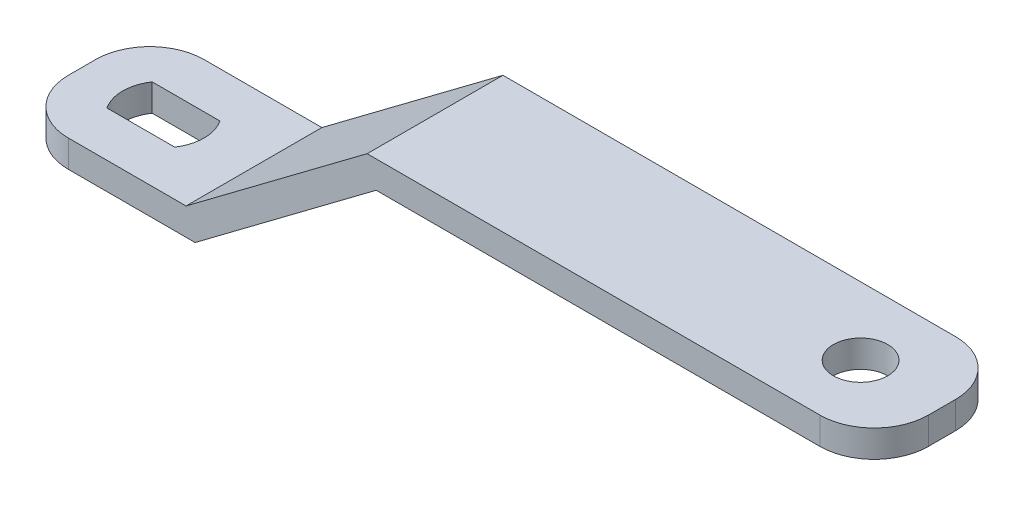
ISO-10303-21;
HEADER;
FILE_DESCRIPTION(('STEP AP214'),'2;1');
FILE_NAME('part.step','',(''),(''),'','','');
FILE_SCHEMA(('AUTOMOTIVE_DESIGN { 1 0 10303 214 1 1 1 1 }'));
ENDSEC;
DATA;
#1=APPLICATION_CONTEXT('core data for automotive mechanical design processes');
#2=APPLICATION_PROTOCOL_DEFINITION('international standard','automotive_design',2000,#1);
#3=PRODUCT_CONTEXT('',#1,'mechanical');
#4=PRODUCT('Part','Part','',(#3));
#5=PRODUCT_RELATED_PRODUCT_CATEGORY('part','',(#4));
#6=PRODUCT_DEFINITION_FORMATION('','',#4);
#7=PRODUCT_DEFINITION_CONTEXT('part definition',#1,'design');
#8=PRODUCT_DEFINITION('design','',#6,#7);
#9=PRODUCT_DEFINITION_SHAPE('','',#8);
#10=(LENGTH_UNIT() NAMED_UNIT(*) SI_UNIT(.MILLI.,.METRE.));
#11=(NAMED_UNIT(*) PLANE_ANGLE_UNIT() SI_UNIT($,.RADIAN.));
#12=(NAMED_UNIT(*) SI_UNIT($,.STERADIAN.) SOLID_ANGLE_UNIT());
#13=UNCERTAINTY_MEASURE_WITH_UNIT(LENGTH_MEASURE(1.E-05),#10,'distance_accuracy_value','');
#14=(GEOMETRIC_REPRESENTATION_CONTEXT(3) GLOBAL_UNCERTAINTY_ASSIGNED_CONTEXT((#13)) GLOBAL_UNIT_ASSIGNED_CONTEXT((#10,
#11,#12)) REPRESENTATION_CONTEXT('',''));
#15=CARTESIAN_POINT('',(0.,0.,0.));
#16=DIRECTION('',(0.,0.,1.));
#17=DIRECTION('',(1.,0.,0.));
#18=AXIS2_PLACEMENT_3D('',#15,#16,#17);
#19=CARTESIAN_POINT('',(0.,3.,15.));
#20=DIRECTION('',(1.,0.,0.));
#21=DIRECTION('',(0.,0.,-1.));
#22=AXIS2_PLACEMENT_3D('',#19,#20,#21);
#23=PLANE('',#22);
#24=DIRECTION('',(0.,0.,-1.));
#25=VECTOR('',#24,1.);
#26=CARTESIAN_POINT('',(0.,0.,15.));
#27=LINE('',#26,#25);
#28=CARTESIAN_POINT('',(0.,0.,8.99999999999996));
#29=VERTEX_POINT('',#28);
#30=CARTESIAN_POINT('',(0.,0.,6.00000000000004));
#31=VERTEX_POINT('',#30);
#32=EDGE_CURVE('E168',#29,#31,#27,.T.);
#33=ORIENTED_EDGE('',*,*,#32,.F.);
#34=DIRECTION('',(0.,1.,0.));
#35=VECTOR('',#34,1.);
#36=CARTESIAN_POINT('',(0.,0.,8.99999999999996));
#37=LINE('',#36,#35);
#38=CARTESIAN_POINT('',(0.,3.,8.99999999999996));
#39=VERTEX_POINT('',#38);
#40=EDGE_CURVE('E284',#29,#39,#37,.T.);
#41=ORIENTED_EDGE('',*,*,#40,.T.);
#42=DIRECTION('',(0.,0.,-1.));
#43=VECTOR('',#42,1.);
#44=CARTESIAN_POINT('',(0.,3.,15.));
#45=LINE('',#44,#43);
#46=CARTESIAN_POINT('',(0.,3.,6.00000000000004));
#47=VERTEX_POINT('',#46);
#48=EDGE_CURVE('E196',#39,#47,#45,.T.);
#49=ORIENTED_EDGE('',*,*,#48,.T.);
#50=DIRECTION('',(0.,1.,0.));
#51=VECTOR('',#50,1.);
#52=CARTESIAN_POINT('',(0.,0.,6.00000000000004));
#53=LINE('',#52,#51);
#54=EDGE_CURVE('E157',#31,#47,#53,.T.);
#55=ORIENTED_EDGE('',*,*,#54,.F.);
#56=EDGE_LOOP('',(#33,#41,#49,#55));
#57=FACE_BOUND('',#56,.T.);
#58=ADVANCED_FACE('F34',(#57),#23,.F.);
#59=CARTESIAN_POINT('',(0.,0.,15.));
#60=DIRECTION('',(0.,1.,0.));
#61=DIRECTION('',(0.,0.,1.));
#62=AXIS2_PLACEMENT_3D('',#59,#60,#61);
#63=PLANE('',#62);
#64=DIRECTION('',(-1.,0.,0.));
#65=VECTOR('',#64,1.);
#66=CARTESIAN_POINT('',(5.25834261322606,0.,5.));
#67=LINE('',#66,#65);
#68=CARTESIAN_POINT('',(12.7416573867739,0.,5.));
#69=VERTEX_POINT('',#68);
#70=CARTESIAN_POINT('',(5.25834261322606,0.,5.));
#71=VERTEX_POINT('',#70);
#72=EDGE_CURVE('E252',#69,#71,#67,.T.);
#73=ORIENTED_EDGE('',*,*,#72,.T.);
#74=CARTESIAN_POINT('',(9.,0.,7.5));
#75=DIRECTION('',(0.,1.,0.));
#76=DIRECTION('',(-1.,0.,0.));
#77=AXIS2_PLACEMENT_3D('',#74,#75,#76);
#78=CIRCLE('',#77,4.5);
#79=CARTESIAN_POINT('',(5.25834261322606,0.,10.));
#80=VERTEX_POINT('',#79);
#81=EDGE_CURVE('E242',#71,#80,#78,.T.);
#82=ORIENTED_EDGE('',*,*,#81,.T.);
#83=DIRECTION('',(1.,0.,0.));
#84=VECTOR('',#83,1.);
#85=CARTESIAN_POINT('',(5.25834261322606,0.,10.));
#86=LINE('',#85,#84);
#87=CARTESIAN_POINT('',(12.7416573867739,0.,10.));
#88=VERTEX_POINT('',#87);
#89=EDGE_CURVE('E296',#80,#88,#86,.T.);
#90=ORIENTED_EDGE('',*,*,#89,.T.);
#91=CARTESIAN_POINT('',(9.,0.,7.5));
#92=DIRECTION('',(0.,1.,0.));
#93=DIRECTION('',(-1.,0.,0.));
#94=AXIS2_PLACEMENT_3D('',#91,#92,#93);
#95=CIRCLE('',#94,4.5);
#96=EDGE_CURVE('E48',#88,#69,#95,.T.);
#97=ORIENTED_EDGE('',*,*,#96,.T.);
#98=EDGE_LOOP('',(#73,#82,#90,#97));
#99=FACE_BOUND('',#98,.T.);
#100=CARTESIAN_POINT('',(6.,0.,9.));
#101=DIRECTION('',(0.,1.,0.));
#102=DIRECTION('',(-1.,0.,0.));
#103=AXIS2_PLACEMENT_3D('',#100,#101,#102);
#104=CIRCLE('',#103,6.);
#105=CARTESIAN_POINT('',(6.,0.,15.));
#106=VERTEX_POINT('',#105);
#107=EDGE_CURVE('E169',#29,#106,#104,.T.);
#108=ORIENTED_EDGE('',*,*,#107,.F.);
#109=ORIENTED_EDGE('',*,*,#32,.T.);
#110=CARTESIAN_POINT('',(6.,0.,6.));
#111=DIRECTION('',(0.,1.,0.));
#112=DIRECTION('',(-1.,0.,0.));
#113=AXIS2_PLACEMENT_3D('',#110,#111,#112);
#114=CIRCLE('',#113,6.);
#115=CARTESIAN_POINT('',(6.00000000000004,0.,0.));
#116=VERTEX_POINT('',#115);
#117=EDGE_CURVE('E149',#116,#31,#114,.T.);
#118=ORIENTED_EDGE('',*,*,#117,.F.);
#119=DIRECTION('',(1.,0.,0.));
#120=VECTOR('',#119,1.);
#121=CARTESIAN_POINT('',(0.,0.,0.));
#122=LINE('',#121,#120);
#123=CARTESIAN_POINT('',(20.,0.,0.));
#124=VERTEX_POINT('',#123);
#125=EDGE_CURVE('E165',#116,#124,#122,.T.);
#126=ORIENTED_EDGE('',*,*,#125,.T.);
#127=DIRECTION('',(0.,0.,-1.));
#128=VECTOR('',#127,1.);
#129=CARTESIAN_POINT('',(20.,0.,15.));
#130=LINE('',#129,#128);
#131=CARTESIAN_POINT('',(20.,0.,15.));
#132=VERTEX_POINT('',#131);
#133=EDGE_CURVE('E214',#132,#124,#130,.T.);
#134=ORIENTED_EDGE('',*,*,#133,.F.);
#135=DIRECTION('',(1.,0.,0.));
#136=VECTOR('',#135,1.);
#137=CARTESIAN_POINT('',(0.,0.,15.));
#138=LINE('',#137,#136);
#139=EDGE_CURVE('E195',#106,#132,#138,.T.);
#140=ORIENTED_EDGE('',*,*,#139,.F.);
#141=EDGE_LOOP('',(#108,#109,#118,#126,#134,#140));
#142=FACE_BOUND('',#141,.T.);
#143=ADVANCED_FACE('F163',(#99,#142),#63,.F.);
#144=CARTESIAN_POINT('',(40.,15.,15.));
#145=DIRECTION('',(0.,1.,0.));
#146=DIRECTION('',(-1.,0.,0.));
#147=AXIS2_PLACEMENT_3D('',#144,#145,#146);
#148=PLANE('',#147);
#149=CARTESIAN_POINT('',(86.,15.,7.5));
#150=DIRECTION('',(0.,1.,0.));
#151=DIRECTION('',(-1.,0.,0.));
#152=AXIS2_PLACEMENT_3D('',#149,#150,#151);
#153=CIRCLE('',#152,3.00000000000001);
#154=CARTESIAN_POINT('',(83.,15.,7.5));
#155=VERTEX_POINT('',#154);
#156=EDGE_CURVE('E176',#155,#155,#153,.T.);
#157=ORIENTED_EDGE('',*,*,#156,.T.);
#158=EDGE_LOOP('',(#157));
#159=FACE_BOUND('',#158,.T.);
#160=CARTESIAN_POINT('',(89.,15.,9.));
#161=DIRECTION('',(0.,1.,0.));
#162=DIRECTION('',(-1.,0.,0.));
#163=AXIS2_PLACEMENT_3D('',#160,#161,#162);
#164=CIRCLE('',#163,6.);
#165=CARTESIAN_POINT('',(89.,15.,15.));
#166=VERTEX_POINT('',#165);
#167=CARTESIAN_POINT('',(95.,15.,8.99999999999996));
#168=VERTEX_POINT('',#167);
#169=EDGE_CURVE('E181',#166,#168,#164,.T.);
#170=ORIENTED_EDGE('',*,*,#169,.F.);
#171=DIRECTION('',(1.,0.,0.));
#172=VECTOR('',#171,1.);
#173=CARTESIAN_POINT('',(40.,15.,15.));
#174=LINE('',#173,#172);
#175=CARTESIAN_POINT('',(40.,15.,15.));
#176=VERTEX_POINT('',#175);
#177=EDGE_CURVE('E265',#176,#166,#174,.T.);
#178=ORIENTED_EDGE('',*,*,#177,.F.);
#179=DIRECTION('',(0.,0.,-1.));
#180=VECTOR('',#179,1.);
#181=CARTESIAN_POINT('',(40.,15.,15.));
#182=LINE('',#181,#180);
#183=CARTESIAN_POINT('',(40.,15.,0.));
#184=VERTEX_POINT('',#183);
#185=EDGE_CURVE('E211',#176,#184,#182,.T.);
#186=ORIENTED_EDGE('',*,*,#185,.T.);
#187=DIRECTION('',(1.,0.,0.));
#188=VECTOR('',#187,1.);
#189=CARTESIAN_POINT('',(40.,15.,0.));
#190=LINE('',#189,#188);
#191=CARTESIAN_POINT('',(89.,15.,0.));
#192=VERTEX_POINT('',#191);
#193=EDGE_CURVE('E178',#184,#192,#190,.T.);
#194=ORIENTED_EDGE('',*,*,#193,.T.);
#195=CARTESIAN_POINT('',(89.,15.,6.));
#196=DIRECTION('',(0.,1.,0.));
#197=DIRECTION('',(-1.,0.,0.));
#198=AXIS2_PLACEMENT_3D('',#195,#196,#197);
#199=CIRCLE('',#198,6.);
#200=CARTESIAN_POINT('',(95.,15.,6.));
#201=VERTEX_POINT('',#200);
#202=EDGE_CURVE('E247',#201,#192,#199,.T.);
#203=ORIENTED_EDGE('',*,*,#202,.F.);
#204=DIRECTION('',(0.,0.,-1.));
#205=VECTOR('',#204,1.);
#206=CARTESIAN_POINT('',(95.,15.,15.));
#207=LINE('',#206,#205);
#208=EDGE_CURVE('E208',#168,#201,#207,.T.);
#209=ORIENTED_EDGE('',*,*,#208,.F.);
#210=EDGE_LOOP('',(#170,#178,#186,#194,#203,#209));
#211=FACE_BOUND('',#210,.T.);
#212=ADVANCED_FACE('F314',(#159,#211),#148,.F.);
#213=CARTESIAN_POINT('',(95.,15.,15.));
#214=DIRECTION('',(-1.,0.,0.));
#215=DIRECTION('',(0.,0.,1.));
#216=AXIS2_PLACEMENT_3D('',#213,#214,#215);
#217=PLANE('',#216);
#218=DIRECTION('',(0.,1.,0.));
#219=VECTOR('',#218,1.);
#220=CARTESIAN_POINT('',(95.,0.,8.99999999999996));
#221=LINE('',#220,#219);
#222=CARTESIAN_POINT('',(95.,18.,8.99999999999996));
#223=VERTEX_POINT('',#222);
#224=EDGE_CURVE('E293',#168,#223,#221,.T.);
#225=ORIENTED_EDGE('',*,*,#224,.F.);
#226=ORIENTED_EDGE('',*,*,#208,.T.);
#227=DIRECTION('',(0.,1.,0.));
#228=VECTOR('',#227,1.);
#229=CARTESIAN_POINT('',(95.,0.,6.));
#230=LINE('',#229,#228);
#231=CARTESIAN_POINT('',(95.,18.,6.));
#232=VERTEX_POINT('',#231);
#233=EDGE_CURVE('E158',#201,#232,#230,.T.);
#234=ORIENTED_EDGE('',*,*,#233,.T.);
#235=DIRECTION('',(0.,0.,-1.));
#236=VECTOR('',#235,1.);
#237=CARTESIAN_POINT('',(95.,18.,15.));
#238=LINE('',#237,#236);
#239=EDGE_CURVE('E205',#223,#232,#238,.T.);
#240=ORIENTED_EDGE('',*,*,#239,.F.);
#241=EDGE_LOOP('',(#225,#226,#234,#240));
#242=FACE_BOUND('',#241,.T.);
#243=ADVANCED_FACE('F318',(#242),#217,.F.);
#244=CARTESIAN_POINT('',(95.,18.,15.));
#245=DIRECTION('',(0.,-1.,0.));
#246=DIRECTION('',(1.,0.,0.));
#247=AXIS2_PLACEMENT_3D('',#244,#245,#246);
#248=PLANE('',#247);
#249=CARTESIAN_POINT('',(86.,18.,7.5));
#250=DIRECTION('',(0.,1.,0.));
#251=DIRECTION('',(-1.,0.,0.));
#252=AXIS2_PLACEMENT_3D('',#249,#250,#251);
#253=CIRCLE('',#252,3.00000000000001);
#254=CARTESIAN_POINT('',(83.,18.,7.5));
#255=VERTEX_POINT('',#254);
#256=EDGE_CURVE('E244',#255,#255,#253,.T.);
#257=ORIENTED_EDGE('',*,*,#256,.F.);
#258=EDGE_LOOP('',(#257));
#259=FACE_BOUND('',#258,.T.);
#260=CARTESIAN_POINT('',(89.,18.,9.));
#261=DIRECTION('',(0.,1.,0.));
#262=DIRECTION('',(-1.,0.,0.));
#263=AXIS2_PLACEMENT_3D('',#260,#261,#262);
#264=CIRCLE('',#263,6.);
#265=CARTESIAN_POINT('',(89.,18.,15.));
#266=VERTEX_POINT('',#265);
#267=EDGE_CURVE('E482',#266,#223,#264,.T.);
#268=ORIENTED_EDGE('',*,*,#267,.T.);
#269=ORIENTED_EDGE('',*,*,#239,.T.);
#270=CARTESIAN_POINT('',(89.,18.,6.));
#271=DIRECTION('',(0.,1.,0.));
#272=DIRECTION('',(1.,0.,0.));
#273=AXIS2_PLACEMENT_3D('',#270,#271,#272);
#274=CIRCLE('',#273,6.);
#275=CARTESIAN_POINT('',(89.,18.,0.));
#276=VERTEX_POINT('',#275);
#277=EDGE_CURVE('E170',#232,#276,#274,.T.);
#278=ORIENTED_EDGE('',*,*,#277,.T.);
#279=DIRECTION('',(-1.,0.,0.));
#280=VECTOR('',#279,1.);
#281=CARTESIAN_POINT('',(95.,18.,0.));
#282=LINE('',#281,#280);
#283=CARTESIAN_POINT('',(39.,18.,0.));
#284=VERTEX_POINT('',#283);
#285=EDGE_CURVE('E189',#276,#284,#282,.T.);
#286=ORIENTED_EDGE('',*,*,#285,.T.);
#287=DIRECTION('',(0.,0.,-1.));
#288=VECTOR('',#287,1.);
#289=CARTESIAN_POINT('',(39.,18.,15.));
#290=LINE('',#289,#288);
#291=CARTESIAN_POINT('',(39.,18.,15.));
#292=VERTEX_POINT('',#291);
#293=EDGE_CURVE('E202',#292,#284,#290,.T.);
#294=ORIENTED_EDGE('',*,*,#293,.F.);
#295=DIRECTION('',(-1.,0.,0.));
#296=VECTOR('',#295,1.);
#297=CARTESIAN_POINT('',(95.,18.,15.));
#298=LINE('',#297,#296);
#299=EDGE_CURVE('E268',#266,#292,#298,.T.);
#300=ORIENTED_EDGE('',*,*,#299,.F.);
#301=EDGE_LOOP('',(#268,#269,#278,#286,#294,#300));
#302=FACE_BOUND('',#301,.T.);
#303=ADVANCED_FACE('F329',(#259,#302),#248,.F.);
#304=CARTESIAN_POINT('',(19.,3.,15.));
#305=DIRECTION('',(0.,-1.,0.));
#306=DIRECTION('',(1.,0.,0.));
#307=AXIS2_PLACEMENT_3D('',#304,#305,#306);
#308=PLANE('',#307);
#309=DIRECTION('',(-1.,0.,0.));
#310=VECTOR('',#309,1.);
#311=CARTESIAN_POINT('',(19.,3.,10.));
#312=LINE('',#311,#310);
#313=CARTESIAN_POINT('',(12.7416573867739,3.,10.));
#314=VERTEX_POINT('',#313);
#315=CARTESIAN_POINT('',(5.25834261322605,3.,10.));
#316=VERTEX_POINT('',#315);
#317=EDGE_CURVE('E222',#314,#316,#312,.T.);
#318=ORIENTED_EDGE('',*,*,#317,.T.);
#319=CARTESIAN_POINT('',(9.,3.,7.5));
#320=DIRECTION('',(0.,-1.,0.));
#321=DIRECTION('',(1.,0.,0.));
#322=AXIS2_PLACEMENT_3D('',#319,#320,#321);
#323=CIRCLE('',#322,4.5);
#324=CARTESIAN_POINT('',(5.25834261322606,3.,5.));
#325=VERTEX_POINT('',#324);
#326=EDGE_CURVE('E12',#316,#325,#323,.T.);
#327=ORIENTED_EDGE('',*,*,#326,.T.);
#328=DIRECTION('',(1.,0.,0.));
#329=VECTOR('',#328,1.);
#330=CARTESIAN_POINT('',(19.,3.,5.));
#331=LINE('',#330,#329);
#332=CARTESIAN_POINT('',(12.7416573867739,3.,5.));
#333=VERTEX_POINT('',#332);
#334=EDGE_CURVE('E41',#325,#333,#331,.T.);
#335=ORIENTED_EDGE('',*,*,#334,.T.);
#336=CARTESIAN_POINT('',(9.,3.,7.5));
#337=DIRECTION('',(0.,-1.,0.));
#338=DIRECTION('',(1.,0.,0.));
#339=AXIS2_PLACEMENT_3D('',#336,#337,#338);
#340=CIRCLE('',#339,4.5);
#341=EDGE_CURVE('E225',#333,#314,#340,.T.);
#342=ORIENTED_EDGE('',*,*,#341,.T.);
#343=EDGE_LOOP('',(#318,#327,#335,#342));
#344=FACE_BOUND('',#343,.T.);
#345=CARTESIAN_POINT('',(6.,3.,9.));
#346=DIRECTION('',(0.,-1.,0.));
#347=DIRECTION('',(1.,0.,0.));
#348=AXIS2_PLACEMENT_3D('',#345,#346,#347);
#349=CIRCLE('',#348,6.);
#350=CARTESIAN_POINT('',(6.00000000000004,3.,15.));
#351=VERTEX_POINT('',#350);
#352=EDGE_CURVE('E259',#351,#39,#349,.T.);
#353=ORIENTED_EDGE('',*,*,#352,.F.);
#354=DIRECTION('',(-1.,0.,0.));
#355=VECTOR('',#354,1.);
#356=CARTESIAN_POINT('',(19.,3.,15.));
#357=LINE('',#356,#355);
#358=CARTESIAN_POINT('',(19.,3.,15.));
#359=VERTEX_POINT('',#358);
#360=EDGE_CURVE('E184',#359,#351,#357,.T.);
#361=ORIENTED_EDGE('',*,*,#360,.F.);
#362=DIRECTION('',(0.,0.,-1.));
#363=VECTOR('',#362,1.);
#364=CARTESIAN_POINT('',(19.,3.,15.));
#365=LINE('',#364,#363);
#366=CARTESIAN_POINT('',(19.,3.,0.));
#367=VERTEX_POINT('',#366);
#368=EDGE_CURVE('E199',#359,#367,#365,.T.);
#369=ORIENTED_EDGE('',*,*,#368,.T.);
#370=DIRECTION('',(-1.,0.,0.));
#371=VECTOR('',#370,1.);
#372=CARTESIAN_POINT('',(19.,3.,0.));
#373=LINE('',#372,#371);
#374=CARTESIAN_POINT('',(6.,3.,0.));
#375=VERTEX_POINT('',#374);
#376=EDGE_CURVE('E193',#367,#375,#373,.T.);
#377=ORIENTED_EDGE('',*,*,#376,.T.);
#378=CARTESIAN_POINT('',(6.,3.,6.));
#379=DIRECTION('',(0.,-1.,0.));
#380=DIRECTION('',(1.,0.,0.));
#381=AXIS2_PLACEMENT_3D('',#378,#379,#380);
#382=CIRCLE('',#381,6.);
#383=EDGE_CURVE('E152',#47,#375,#382,.T.);
#384=ORIENTED_EDGE('',*,*,#383,.F.);
#385=ORIENTED_EDGE('',*,*,#48,.F.);
#386=EDGE_LOOP('',(#353,#361,#369,#377,#384,#385));
#387=FACE_BOUND('',#386,.T.);
#388=ADVANCED_FACE('F229',(#344,#387),#308,.F.);
#389=CARTESIAN_POINT('',(0.,0.,15.));
#390=DIRECTION('',(0.,0.,1.));
#391=DIRECTION('',(1.,0.,0.));
#392=AXIS2_PLACEMENT_3D('',#389,#390,#391);
#393=PLANE('',#392);
#394=ORIENTED_EDGE('',*,*,#177,.T.);
#395=DIRECTION('',(0.,1.,0.));
#396=VECTOR('',#395,1.);
#397=CARTESIAN_POINT('',(89.,0.,15.));
#398=LINE('',#397,#396);
#399=EDGE_CURVE('E219',#166,#266,#398,.T.);
#400=ORIENTED_EDGE('',*,*,#399,.T.);
#401=ORIENTED_EDGE('',*,*,#299,.T.);
#402=DIRECTION('',(-0.8,-0.6,0.));
#403=VECTOR('',#402,1.);
#404=CARTESIAN_POINT('',(39.,18.,15.));
#405=LINE('',#404,#403);
#406=EDGE_CURVE('E269',#292,#359,#405,.T.);
#407=ORIENTED_EDGE('',*,*,#406,.T.);
#408=ORIENTED_EDGE('',*,*,#360,.T.);
#409=DIRECTION('',(0.,1.,0.));
#410=VECTOR('',#409,1.);
#411=CARTESIAN_POINT('',(6.00000000000004,0.,15.));
#412=LINE('',#411,#410);
#413=EDGE_CURVE('E277',#106,#351,#412,.T.);
#414=ORIENTED_EDGE('',*,*,#413,.F.);
#415=ORIENTED_EDGE('',*,*,#139,.T.);
#416=DIRECTION('',(0.8,0.6,0.));
#417=VECTOR('',#416,1.);
#418=CARTESIAN_POINT('',(20.,0.,15.));
#419=LINE('',#418,#417);
#420=EDGE_CURVE('E263',#132,#176,#419,.T.);
#421=ORIENTED_EDGE('',*,*,#420,.T.);
#422=EDGE_LOOP('',(#394,#400,#401,#407,#408,#414,#415,#421));
#423=FACE_BOUND('',#422,.T.);
#424=ADVANCED_FACE('F276',(#423),#393,.T.);
#425=CARTESIAN_POINT('',(0.,0.,0.));
#426=DIRECTION('',(0.,0.,1.));
#427=DIRECTION('',(1.,0.,0.));
#428=AXIS2_PLACEMENT_3D('',#425,#426,#427);
#429=PLANE('',#428);
#430=ORIENTED_EDGE('',*,*,#125,.F.);
#431=DIRECTION('',(0.,1.,0.));
#432=VECTOR('',#431,1.);
#433=CARTESIAN_POINT('',(6.00000000000004,0.,0.));
#434=LINE('',#433,#432);
#435=EDGE_CURVE('E146',#116,#375,#434,.T.);
#436=ORIENTED_EDGE('',*,*,#435,.T.);
#437=ORIENTED_EDGE('',*,*,#376,.F.);
#438=DIRECTION('',(-0.8,-0.6,0.));
#439=VECTOR('',#438,1.);
#440=CARTESIAN_POINT('',(39.,18.,0.));
#441=LINE('',#440,#439);
#442=EDGE_CURVE('E191',#284,#367,#441,.T.);
#443=ORIENTED_EDGE('',*,*,#442,.F.);
#444=ORIENTED_EDGE('',*,*,#285,.F.);
#445=DIRECTION('',(0.,1.,0.));
#446=VECTOR('',#445,1.);
#447=CARTESIAN_POINT('',(89.,0.,0.));
#448=LINE('',#447,#446);
#449=EDGE_CURVE('E217',#192,#276,#448,.T.);
#450=ORIENTED_EDGE('',*,*,#449,.F.);
#451=ORIENTED_EDGE('',*,*,#193,.F.);
#452=DIRECTION('',(0.8,0.6,0.));
#453=VECTOR('',#452,1.);
#454=CARTESIAN_POINT('',(20.,0.,0.));
#455=LINE('',#454,#453);
#456=EDGE_CURVE('E175',#124,#184,#455,.T.);
#457=ORIENTED_EDGE('',*,*,#456,.F.);
#458=EDGE_LOOP('',(#430,#436,#437,#443,#444,#450,#451,#457));
#459=FACE_BOUND('',#458,.T.);
#460=ADVANCED_FACE('F173',(#459),#429,.F.);
#461=CARTESIAN_POINT('',(20.,0.,15.));
#462=DIRECTION('',(-0.6,0.8,0.));
#463=DIRECTION('',(-0.8,-0.600000000000001,0.));
#464=AXIS2_PLACEMENT_3D('',#461,#462,#463);
#465=PLANE('',#464);
#466=ORIENTED_EDGE('',*,*,#456,.T.);
#467=ORIENTED_EDGE('',*,*,#185,.F.);
#468=ORIENTED_EDGE('',*,*,#420,.F.);
#469=ORIENTED_EDGE('',*,*,#133,.T.);
#470=EDGE_LOOP('',(#466,#467,#468,#469));
#471=FACE_BOUND('',#470,.T.);
#472=ADVANCED_FACE('F322',(#471),#465,.F.);
#473=CARTESIAN_POINT('',(39.,18.,15.));
#474=DIRECTION('',(0.6,-0.8,0.));
#475=DIRECTION('',(0.8,0.6,0.));
#476=AXIS2_PLACEMENT_3D('',#473,#474,#475);
#477=PLANE('',#476);
#478=ORIENTED_EDGE('',*,*,#442,.T.);
#479=ORIENTED_EDGE('',*,*,#368,.F.);
#480=ORIENTED_EDGE('',*,*,#406,.F.);
#481=ORIENTED_EDGE('',*,*,#293,.T.);
#482=EDGE_LOOP('',(#478,#479,#480,#481));
#483=FACE_BOUND('',#482,.T.);
#484=ADVANCED_FACE('F324',(#483),#477,.F.);
#485=CARTESIAN_POINT('',(89.,0.,6.));
#486=DIRECTION('',(0.,1.,0.));
#487=DIRECTION('',(-1.,0.,0.));
#488=AXIS2_PLACEMENT_3D('',#485,#486,#487);
#489=CYLINDRICAL_SURFACE('',#488,6.);
#490=ORIENTED_EDGE('',*,*,#202,.T.);
#491=ORIENTED_EDGE('',*,*,#449,.T.);
#492=ORIENTED_EDGE('',*,*,#277,.F.);
#493=ORIENTED_EDGE('',*,*,#233,.F.);
#494=EDGE_LOOP('',(#490,#491,#492,#493));
#495=FACE_BOUND('',#494,.T.);
#496=ADVANCED_FACE('F336',(#495),#489,.T.);
#497=CARTESIAN_POINT('',(6.,0.,6.));
#498=DIRECTION('',(0.,1.,0.));
#499=DIRECTION('',(-1.,0.,0.));
#500=AXIS2_PLACEMENT_3D('',#497,#498,#499);
#501=CYLINDRICAL_SURFACE('',#500,6.);
#502=ORIENTED_EDGE('',*,*,#383,.T.);
#503=ORIENTED_EDGE('',*,*,#435,.F.);
#504=ORIENTED_EDGE('',*,*,#117,.T.);
#505=ORIENTED_EDGE('',*,*,#54,.T.);
#506=EDGE_LOOP('',(#502,#503,#504,#505));
#507=FACE_BOUND('',#506,.T.);
#508=ADVANCED_FACE('F148',(#507),#501,.T.);
#509=CARTESIAN_POINT('',(6.,0.,9.));
#510=DIRECTION('',(0.,1.,0.));
#511=DIRECTION('',(-1.,0.,0.));
#512=AXIS2_PLACEMENT_3D('',#509,#510,#511);
#513=CYLINDRICAL_SURFACE('',#512,6.);
#514=ORIENTED_EDGE('',*,*,#352,.T.);
#515=ORIENTED_EDGE('',*,*,#40,.F.);
#516=ORIENTED_EDGE('',*,*,#107,.T.);
#517=ORIENTED_EDGE('',*,*,#413,.T.);
#518=EDGE_LOOP('',(#514,#515,#516,#517));
#519=FACE_BOUND('',#518,.T.);
#520=ADVANCED_FACE('F283',(#519),#513,.T.);
#521=CARTESIAN_POINT('',(89.,0.,9.));
#522=DIRECTION('',(0.,1.,0.));
#523=DIRECTION('',(-1.,0.,0.));
#524=AXIS2_PLACEMENT_3D('',#521,#522,#523);
#525=CYLINDRICAL_SURFACE('',#524,6.);
#526=ORIENTED_EDGE('',*,*,#169,.T.);
#527=ORIENTED_EDGE('',*,*,#224,.T.);
#528=ORIENTED_EDGE('',*,*,#267,.F.);
#529=ORIENTED_EDGE('',*,*,#399,.F.);
#530=EDGE_LOOP('',(#526,#527,#528,#529));
#531=FACE_BOUND('',#530,.T.);
#532=ADVANCED_FACE('F348',(#531),#525,.T.);
#533=CARTESIAN_POINT('',(9.,0.,7.5));
#534=DIRECTION('',(0.,1.,0.));
#535=DIRECTION('',(-1.,0.,0.));
#536=AXIS2_PLACEMENT_3D('',#533,#534,#535);
#537=CYLINDRICAL_SURFACE('',#536,4.5);
#538=DIRECTION('',(0.,1.,0.));
#539=VECTOR('',#538,1.);
#540=CARTESIAN_POINT('',(5.25834261322606,0.,10.));
#541=LINE('',#540,#539);
#542=EDGE_CURVE('E56',#80,#316,#541,.T.);
#543=ORIENTED_EDGE('',*,*,#542,.F.);
#544=ORIENTED_EDGE('',*,*,#81,.F.);
#545=DIRECTION('',(0.,1.,0.));
#546=VECTOR('',#545,1.);
#547=CARTESIAN_POINT('',(5.25834261322606,0.,5.));
#548=LINE('',#547,#546);
#549=EDGE_CURVE('E236',#71,#325,#548,.T.);
#550=ORIENTED_EDGE('',*,*,#549,.T.);
#551=ORIENTED_EDGE('',*,*,#326,.F.);
#552=EDGE_LOOP('',(#543,#544,#550,#551));
#553=FACE_BOUND('',#552,.T.);
#554=ADVANCED_FACE('F240',(#553),#537,.F.);
#555=CARTESIAN_POINT('',(5.25834261322606,0.,5.));
#556=DIRECTION('',(0.,0.,-1.));
#557=DIRECTION('',(-1.,0.,0.));
#558=AXIS2_PLACEMENT_3D('',#555,#556,#557);
#559=PLANE('',#558);
#560=ORIENTED_EDGE('',*,*,#549,.F.);
#561=ORIENTED_EDGE('',*,*,#72,.F.);
#562=DIRECTION('',(0.,1.,0.));
#563=VECTOR('',#562,1.);
#564=CARTESIAN_POINT('',(12.7416573867739,0.,5.));
#565=LINE('',#564,#563);
#566=EDGE_CURVE('E238',#69,#333,#565,.T.);
#567=ORIENTED_EDGE('',*,*,#566,.T.);
#568=ORIENTED_EDGE('',*,*,#334,.F.);
#569=EDGE_LOOP('',(#560,#561,#567,#568));
#570=FACE_BOUND('',#569,.T.);
#571=ADVANCED_FACE('F234',(#570),#559,.F.);
#572=CARTESIAN_POINT('',(9.,0.,7.5));
#573=DIRECTION('',(0.,1.,0.));
#574=DIRECTION('',(-1.,0.,0.));
#575=AXIS2_PLACEMENT_3D('',#572,#573,#574);
#576=CYLINDRICAL_SURFACE('',#575,4.5);
#577=ORIENTED_EDGE('',*,*,#566,.F.);
#578=ORIENTED_EDGE('',*,*,#96,.F.);
#579=DIRECTION('',(0.,1.,0.));
#580=VECTOR('',#579,1.);
#581=CARTESIAN_POINT('',(12.7416573867739,0.,10.));
#582=LINE('',#581,#580);
#583=EDGE_CURVE('E249',#88,#314,#582,.T.);
#584=ORIENTED_EDGE('',*,*,#583,.T.);
#585=ORIENTED_EDGE('',*,*,#341,.F.);
#586=EDGE_LOOP('',(#577,#578,#584,#585));
#587=FACE_BOUND('',#586,.T.);
#588=ADVANCED_FACE('F300',(#587),#576,.F.);
#589=CARTESIAN_POINT('',(5.25834261322606,0.,10.));
#590=DIRECTION('',(0.,0.,1.));
#591=DIRECTION('',(1.,0.,0.));
#592=AXIS2_PLACEMENT_3D('',#589,#590,#591);
#593=PLANE('',#592);
#594=ORIENTED_EDGE('',*,*,#583,.F.);
#595=ORIENTED_EDGE('',*,*,#89,.F.);
#596=ORIENTED_EDGE('',*,*,#542,.T.);
#597=ORIENTED_EDGE('',*,*,#317,.F.);
#598=EDGE_LOOP('',(#594,#595,#596,#597));
#599=FACE_BOUND('',#598,.T.);
#600=ADVANCED_FACE('F299',(#599),#593,.F.);
#601=CARTESIAN_POINT('',(86.,0.,7.5));
#602=DIRECTION('',(0.,1.,0.));
#603=DIRECTION('',(-1.,0.,0.));
#604=AXIS2_PLACEMENT_3D('',#601,#602,#603);
#605=CYLINDRICAL_SURFACE('',#604,3.00000000000001);
#606=ORIENTED_EDGE('',*,*,#256,.T.);
#607=EDGE_LOOP('',(#606));
#608=FACE_BOUND('',#607,.T.);
#609=ORIENTED_EDGE('',*,*,#156,.F.);
#610=EDGE_LOOP('',(#609));
#611=FACE_BOUND('',#610,.T.);
#612=ADVANCED_FACE('F307',(#608,#611),#605,.F.);
#613=CLOSED_SHELL('',(#58,#143,#212,#243,#303,#388,#424,#460,#472,#484,#496,#508,#520,#532,#554,
#571,#588,#600,#612));
#614=MANIFOLD_SOLID_BREP('B2',#613);
#615=ADVANCED_BREP_SHAPE_REPRESENTATION('',(#18,#614),#14);
#616=SHAPE_DEFINITION_REPRESENTATION(#9,#615);
ENDSEC;
END-ISO-10303-21;
